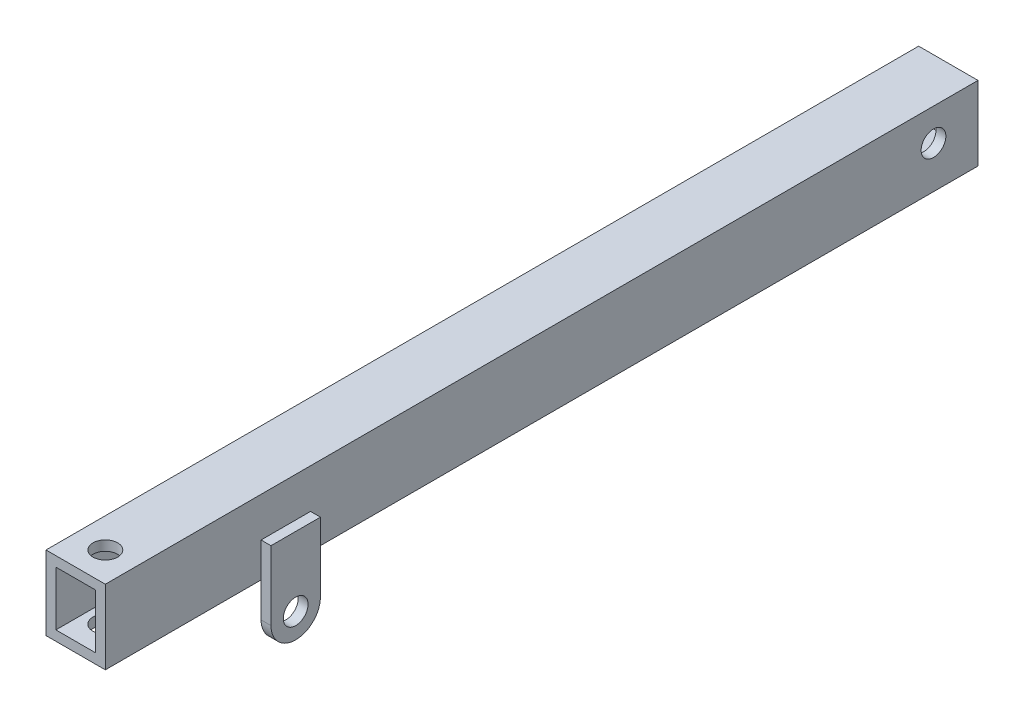
ISO-10303-21;
HEADER;
FILE_DESCRIPTION(('STEP AP214'),'2;1');
FILE_NAME('part.step','',(''),(''),'','','');
FILE_SCHEMA(('AUTOMOTIVE_DESIGN { 1 0 10303 214 1 1 1 1 }'));
ENDSEC;
DATA;
#1=APPLICATION_CONTEXT('core data for automotive mechanical design processes');
#2=APPLICATION_PROTOCOL_DEFINITION('international standard','automotive_design',2000,#1);
#3=PRODUCT_CONTEXT('',#1,'mechanical');
#4=PRODUCT('Part','Part','',(#3));
#5=PRODUCT_RELATED_PRODUCT_CATEGORY('part','',(#4));
#6=PRODUCT_DEFINITION_FORMATION('','',#4);
#7=PRODUCT_DEFINITION_CONTEXT('part definition',#1,'design');
#8=PRODUCT_DEFINITION('design','',#6,#7);
#9=PRODUCT_DEFINITION_SHAPE('','',#8);
#10=(LENGTH_UNIT() NAMED_UNIT(*) SI_UNIT(.MILLI.,.METRE.));
#11=(NAMED_UNIT(*) PLANE_ANGLE_UNIT() SI_UNIT($,.RADIAN.));
#12=(NAMED_UNIT(*) SI_UNIT($,.STERADIAN.) SOLID_ANGLE_UNIT());
#13=UNCERTAINTY_MEASURE_WITH_UNIT(LENGTH_MEASURE(1.E-05),#10,'distance_accuracy_value','');
#14=(GEOMETRIC_REPRESENTATION_CONTEXT(3) GLOBAL_UNCERTAINTY_ASSIGNED_CONTEXT((#13)) GLOBAL_UNIT_ASSIGNED_CONTEXT((#10,
#11,#12)) REPRESENTATION_CONTEXT('',''));
#15=CARTESIAN_POINT('',(0.,0.,0.));
#16=DIRECTION('',(0.,0.,1.));
#17=DIRECTION('',(1.,0.,0.));
#18=AXIS2_PLACEMENT_3D('',#15,#16,#17);
#19=CARTESIAN_POINT('',(6.,-7.5,176.5));
#20=DIRECTION('',(-1.,0.,0.));
#21=DIRECTION('',(0.,0.,1.));
#22=AXIS2_PLACEMENT_3D('',#19,#20,#21);
#23=PLANE('',#22);
#24=CARTESIAN_POINT('',(6.,0.999999999999995,9.));
#25=DIRECTION('',(1.,0.,0.));
#26=DIRECTION('',(0.,0.,-1.));
#27=AXIS2_PLACEMENT_3D('',#24,#25,#26);
#28=CIRCLE('',#27,2.5);
#29=CARTESIAN_POINT('',(6.,0.999999999999995,6.5));
#30=VERTEX_POINT('',#29);
#31=EDGE_CURVE('E441',#30,#30,#28,.T.);
#32=ORIENTED_EDGE('',*,*,#31,.F.);
#33=EDGE_LOOP('',(#32));
#34=FACE_BOUND('',#33,.T.);
#35=DIRECTION('',(0.,0.,-1.));
#36=VECTOR('',#35,1.);
#37=CARTESIAN_POINT('',(6.,-7.5,176.5));
#38=LINE('',#37,#36);
#39=CARTESIAN_POINT('',(6.,-7.5,135.));
#40=VERTEX_POINT('',#39);
#41=CARTESIAN_POINT('',(6.,-7.5,0.));
#42=VERTEX_POINT('',#41);
#43=EDGE_CURVE('E193',#40,#42,#38,.T.);
#44=ORIENTED_EDGE('',*,*,#43,.T.);
#45=DIRECTION('',(0.,1.,0.));
#46=VECTOR('',#45,1.);
#47=CARTESIAN_POINT('',(6.,-7.5,0.));
#48=LINE('',#47,#46);
#49=CARTESIAN_POINT('',(6.,7.5,0.));
#50=VERTEX_POINT('',#49);
#51=EDGE_CURVE('E59',#42,#50,#48,.T.);
#52=ORIENTED_EDGE('',*,*,#51,.T.);
#53=DIRECTION('',(0.,0.,-1.));
#54=VECTOR('',#53,1.);
#55=CARTESIAN_POINT('',(6.,7.5,176.5));
#56=LINE('',#55,#54);
#57=CARTESIAN_POINT('',(6.,7.5,176.5));
#58=VERTEX_POINT('',#57);
#59=EDGE_CURVE('E174',#58,#50,#56,.T.);
#60=ORIENTED_EDGE('',*,*,#59,.F.);
#61=DIRECTION('',(0.,1.,0.));
#62=VECTOR('',#61,1.);
#63=CARTESIAN_POINT('',(6.,-7.5,176.5));
#64=LINE('',#63,#62);
#65=CARTESIAN_POINT('',(6.,-7.5,176.5));
#66=VERTEX_POINT('',#65);
#67=EDGE_CURVE('E206',#66,#58,#64,.T.);
#68=ORIENTED_EDGE('',*,*,#67,.F.);
#69=CARTESIAN_POINT('',(6.,-7.5,145.));
#70=VERTEX_POINT('',#69);
#71=EDGE_CURVE('E183',#66,#70,#38,.T.);
#72=ORIENTED_EDGE('',*,*,#71,.T.);
#73=DIRECTION('',(0.,-1.,0.));
#74=VECTOR('',#73,1.);
#75=CARTESIAN_POINT('',(6.,-14.5,145.));
#76=LINE('',#75,#74);
#77=CARTESIAN_POINT('',(6.,-0.500000000000005,145.));
#78=VERTEX_POINT('',#77);
#79=EDGE_CURVE('E246',#78,#70,#76,.T.);
#80=ORIENTED_EDGE('',*,*,#79,.F.);
#81=DIRECTION('',(0.,0.,1.));
#82=VECTOR('',#81,1.);
#83=CARTESIAN_POINT('',(6.,-0.500000000000005,145.));
#84=LINE('',#83,#82);
#85=CARTESIAN_POINT('',(6.,-0.500000000000005,135.));
#86=VERTEX_POINT('',#85);
#87=EDGE_CURVE('E247',#86,#78,#84,.T.);
#88=ORIENTED_EDGE('',*,*,#87,.F.);
#89=DIRECTION('',(0.,1.,0.));
#90=VECTOR('',#89,1.);
#91=CARTESIAN_POINT('',(6.,-14.5,135.));
#92=LINE('',#91,#90);
#93=EDGE_CURVE('E263',#40,#86,#92,.T.);
#94=ORIENTED_EDGE('',*,*,#93,.F.);
#95=EDGE_LOOP('',(#44,#52,#60,#68,#72,#80,#88,#94));
#96=FACE_BOUND('',#95,.T.);
#97=ADVANCED_FACE('F39',(#34,#96),#23,.F.);
#98=CARTESIAN_POINT('',(-6.,-7.5,176.5));
#99=DIRECTION('',(1.,0.,0.));
#100=DIRECTION('',(0.,0.,-1.));
#101=AXIS2_PLACEMENT_3D('',#98,#99,#100);
#102=PLANE('',#101);
#103=CARTESIAN_POINT('',(-6.,0.999999999999995,9.));
#104=DIRECTION('',(1.,0.,0.));
#105=DIRECTION('',(0.,0.,-1.));
#106=AXIS2_PLACEMENT_3D('',#103,#104,#105);
#107=CIRCLE('',#106,2.5);
#108=CARTESIAN_POINT('',(-6.,0.999999999999995,6.5));
#109=VERTEX_POINT('',#108);
#110=EDGE_CURVE('E404',#109,#109,#107,.T.);
#111=ORIENTED_EDGE('',*,*,#110,.T.);
#112=EDGE_LOOP('',(#111));
#113=FACE_BOUND('',#112,.T.);
#114=DIRECTION('',(0.,0.,-1.));
#115=VECTOR('',#114,1.);
#116=CARTESIAN_POINT('',(-6.,7.5,176.5));
#117=LINE('',#116,#115);
#118=CARTESIAN_POINT('',(-6.,7.5,176.5));
#119=VERTEX_POINT('',#118);
#120=CARTESIAN_POINT('',(-6.,7.5,0.));
#121=VERTEX_POINT('',#120);
#122=EDGE_CURVE('E171',#119,#121,#117,.T.);
#123=ORIENTED_EDGE('',*,*,#122,.T.);
#124=DIRECTION('',(0.,1.,0.));
#125=VECTOR('',#124,1.);
#126=CARTESIAN_POINT('',(-6.,7.5,0.));
#127=LINE('',#126,#125);
#128=CARTESIAN_POINT('',(-6.,-7.5,0.));
#129=VERTEX_POINT('',#128);
#130=EDGE_CURVE('E11',#129,#121,#127,.T.);
#131=ORIENTED_EDGE('',*,*,#130,.F.);
#132=DIRECTION('',(0.,0.,-1.));
#133=VECTOR('',#132,1.);
#134=CARTESIAN_POINT('',(-6.,-7.5,176.5));
#135=LINE('',#134,#133);
#136=CARTESIAN_POINT('',(-6.,-7.5,135.));
#137=VERTEX_POINT('',#136);
#138=EDGE_CURVE('E348',#137,#129,#135,.T.);
#139=ORIENTED_EDGE('',*,*,#138,.F.);
#140=DIRECTION('',(0.,1.,0.));
#141=VECTOR('',#140,1.);
#142=CARTESIAN_POINT('',(-6.,-14.5,135.));
#143=LINE('',#142,#141);
#144=CARTESIAN_POINT('',(-6.,-0.500000000000005,135.));
#145=VERTEX_POINT('',#144);
#146=EDGE_CURVE('E182',#137,#145,#143,.T.);
#147=ORIENTED_EDGE('',*,*,#146,.T.);
#148=DIRECTION('',(0.,0.,1.));
#149=VECTOR('',#148,1.);
#150=CARTESIAN_POINT('',(-6.,-0.500000000000005,145.));
#151=LINE('',#150,#149);
#152=CARTESIAN_POINT('',(-6.,-0.500000000000005,145.));
#153=VERTEX_POINT('',#152);
#154=EDGE_CURVE('E188',#145,#153,#151,.T.);
#155=ORIENTED_EDGE('',*,*,#154,.T.);
#156=DIRECTION('',(0.,-1.,0.));
#157=VECTOR('',#156,1.);
#158=CARTESIAN_POINT('',(-6.,-14.5,145.));
#159=LINE('',#158,#157);
#160=CARTESIAN_POINT('',(-6.,-7.5,145.));
#161=VERTEX_POINT('',#160);
#162=EDGE_CURVE('E210',#153,#161,#159,.T.);
#163=ORIENTED_EDGE('',*,*,#162,.T.);
#164=CARTESIAN_POINT('',(-6.,-7.5,176.5));
#165=VERTEX_POINT('',#164);
#166=EDGE_CURVE('E362',#165,#161,#135,.T.);
#167=ORIENTED_EDGE('',*,*,#166,.F.);
#168=DIRECTION('',(0.,-1.,0.));
#169=VECTOR('',#168,1.);
#170=CARTESIAN_POINT('',(-6.,-7.5,176.5));
#171=LINE('',#170,#169);
#172=EDGE_CURVE('E180',#119,#165,#171,.T.);
#173=ORIENTED_EDGE('',*,*,#172,.F.);
#174=EDGE_LOOP('',(#123,#131,#139,#147,#155,#163,#167,#173));
#175=FACE_BOUND('',#174,.T.);
#176=ADVANCED_FACE('F178',(#113,#175),#102,.F.);
#177=CARTESIAN_POINT('',(0.,0.,176.5));
#178=DIRECTION('',(0.,0.,-1.));
#179=DIRECTION('',(-1.,0.,0.));
#180=AXIS2_PLACEMENT_3D('',#177,#178,#179);
#181=PLANE('',#180);
#182=ORIENTED_EDGE('',*,*,#67,.T.);
#183=DIRECTION('',(-1.,0.,0.));
#184=VECTOR('',#183,1.);
#185=CARTESIAN_POINT('',(-6.,7.5,176.5));
#186=LINE('',#185,#184);
#187=EDGE_CURVE('E203',#58,#119,#186,.T.);
#188=ORIENTED_EDGE('',*,*,#187,.T.);
#189=ORIENTED_EDGE('',*,*,#172,.T.);
#190=DIRECTION('',(1.,0.,0.));
#191=VECTOR('',#190,1.);
#192=CARTESIAN_POINT('',(-6.,-7.5,176.5));
#193=LINE('',#192,#191);
#194=EDGE_CURVE('E198',#165,#66,#193,.T.);
#195=ORIENTED_EDGE('',*,*,#194,.T.);
#196=EDGE_LOOP('',(#182,#188,#189,#195));
#197=FACE_BOUND('',#196,.T.);
#198=DIRECTION('',(0.,1.,0.));
#199=VECTOR('',#198,1.);
#200=CARTESIAN_POINT('',(4.,-5.5,176.5));
#201=LINE('',#200,#199);
#202=CARTESIAN_POINT('',(4.,-5.5,176.5));
#203=VERTEX_POINT('',#202);
#204=CARTESIAN_POINT('',(4.,5.5,176.5));
#205=VERTEX_POINT('',#204);
#206=EDGE_CURVE('E216',#203,#205,#201,.T.);
#207=ORIENTED_EDGE('',*,*,#206,.F.);
#208=DIRECTION('',(1.,0.,0.));
#209=VECTOR('',#208,1.);
#210=CARTESIAN_POINT('',(-4.,-5.5,176.5));
#211=LINE('',#210,#209);
#212=CARTESIAN_POINT('',(-4.,-5.5,176.5));
#213=VERTEX_POINT('',#212);
#214=EDGE_CURVE('E226',#213,#203,#211,.T.);
#215=ORIENTED_EDGE('',*,*,#214,.F.);
#216=DIRECTION('',(0.,-1.,0.));
#217=VECTOR('',#216,1.);
#218=CARTESIAN_POINT('',(-4.,-5.5,176.5));
#219=LINE('',#218,#217);
#220=CARTESIAN_POINT('',(-4.,5.5,176.5));
#221=VERTEX_POINT('',#220);
#222=EDGE_CURVE('E221',#221,#213,#219,.T.);
#223=ORIENTED_EDGE('',*,*,#222,.F.);
#224=DIRECTION('',(-1.,0.,0.));
#225=VECTOR('',#224,1.);
#226=CARTESIAN_POINT('',(-4.,5.5,176.5));
#227=LINE('',#226,#225);
#228=EDGE_CURVE('E215',#205,#221,#227,.T.);
#229=ORIENTED_EDGE('',*,*,#228,.F.);
#230=EDGE_LOOP('',(#207,#215,#223,#229));
#231=FACE_BOUND('',#230,.T.);
#232=ADVANCED_FACE('F396',(#197,#231),#181,.F.);
#233=CARTESIAN_POINT('',(-6.,7.5,176.5));
#234=DIRECTION('',(0.,-1.,0.));
#235=DIRECTION('',(0.,0.,-1.));
#236=AXIS2_PLACEMENT_3D('',#233,#234,#235);
#237=PLANE('',#236);
#238=CARTESIAN_POINT('',(6.10622663543836E-13,7.5,170.499999999997));
#239=DIRECTION('',(0.,1.,0.));
#240=DIRECTION('',(0.,0.,1.));
#241=AXIS2_PLACEMENT_3D('',#238,#239,#240);
#242=CIRCLE('',#241,2.5);
#243=CARTESIAN_POINT('',(6.10622663543836E-13,7.5,172.999999999997));
#244=VERTEX_POINT('',#243);
#245=EDGE_CURVE('E353',#244,#244,#242,.T.);
#246=ORIENTED_EDGE('',*,*,#245,.F.);
#247=EDGE_LOOP('',(#246));
#248=FACE_BOUND('',#247,.T.);
#249=ORIENTED_EDGE('',*,*,#59,.T.);
#250=DIRECTION('',(-1.,0.,0.));
#251=VECTOR('',#250,1.);
#252=CARTESIAN_POINT('',(8.,7.5,0.));
#253=LINE('',#252,#251);
#254=EDGE_CURVE('E162',#50,#121,#253,.T.);
#255=ORIENTED_EDGE('',*,*,#254,.T.);
#256=ORIENTED_EDGE('',*,*,#122,.F.);
#257=ORIENTED_EDGE('',*,*,#187,.F.);
#258=EDGE_LOOP('',(#249,#255,#256,#257));
#259=FACE_BOUND('',#258,.T.);
#260=ADVANCED_FACE('F170',(#248,#259),#237,.F.);
#261=CARTESIAN_POINT('',(-6.,-7.5,176.5));
#262=DIRECTION('',(0.,1.,0.));
#263=DIRECTION('',(0.,0.,1.));
#264=AXIS2_PLACEMENT_3D('',#261,#262,#263);
#265=PLANE('',#264);
#266=CARTESIAN_POINT('',(6.10622663543836E-13,-7.5,170.499999999997));
#267=DIRECTION('',(0.,1.,0.));
#268=DIRECTION('',(0.,0.,1.));
#269=AXIS2_PLACEMENT_3D('',#266,#267,#268);
#270=CIRCLE('',#269,2.5);
#271=CARTESIAN_POINT('',(6.10622663543836E-13,-7.5,172.999999999997));
#272=VERTEX_POINT('',#271);
#273=EDGE_CURVE('E176',#272,#272,#270,.T.);
#274=ORIENTED_EDGE('',*,*,#273,.T.);
#275=EDGE_LOOP('',(#274));
#276=FACE_BOUND('',#275,.T.);
#277=ORIENTED_EDGE('',*,*,#138,.T.);
#278=DIRECTION('',(1.,0.,0.));
#279=VECTOR('',#278,1.);
#280=CARTESIAN_POINT('',(-6.,-7.5,0.));
#281=LINE('',#280,#279);
#282=EDGE_CURVE('E159',#129,#42,#281,.T.);
#283=ORIENTED_EDGE('',*,*,#282,.T.);
#284=ORIENTED_EDGE('',*,*,#43,.F.);
#285=EDGE_CURVE('E194',#70,#40,#38,.T.);
#286=ORIENTED_EDGE('',*,*,#285,.F.);
#287=ORIENTED_EDGE('',*,*,#71,.F.);
#288=ORIENTED_EDGE('',*,*,#194,.F.);
#289=ORIENTED_EDGE('',*,*,#166,.T.);
#290=EDGE_CURVE('E241',#161,#137,#135,.T.);
#291=ORIENTED_EDGE('',*,*,#290,.T.);
#292=EDGE_LOOP('',(#277,#283,#284,#286,#287,#288,#289,#291));
#293=FACE_BOUND('',#292,.T.);
#294=ADVANCED_FACE('F377',(#276,#293),#265,.F.);
#295=CARTESIAN_POINT('',(4.,-5.5,176.5));
#296=DIRECTION('',(-1.,0.,0.));
#297=DIRECTION('',(0.,0.,1.));
#298=AXIS2_PLACEMENT_3D('',#295,#296,#297);
#299=PLANE('',#298);
#300=CARTESIAN_POINT('',(4.,0.999999999999995,9.));
#301=DIRECTION('',(-1.,0.,0.));
#302=DIRECTION('',(0.,0.,1.));
#303=AXIS2_PLACEMENT_3D('',#300,#301,#302);
#304=CIRCLE('',#303,2.5);
#305=CARTESIAN_POINT('',(4.,0.999999999999995,11.5));
#306=VERTEX_POINT('',#305);
#307=EDGE_CURVE('E407',#306,#306,#304,.T.);
#308=ORIENTED_EDGE('',*,*,#307,.F.);
#309=EDGE_LOOP('',(#308));
#310=FACE_BOUND('',#309,.T.);
#311=DIRECTION('',(0.,1.,0.));
#312=VECTOR('',#311,1.);
#313=CARTESIAN_POINT('',(4.,-5.5,0.));
#314=LINE('',#313,#312);
#315=CARTESIAN_POINT('',(4.,-5.5,0.));
#316=VERTEX_POINT('',#315);
#317=CARTESIAN_POINT('',(4.,5.5,0.));
#318=VERTEX_POINT('',#317);
#319=EDGE_CURVE('E357',#316,#318,#314,.T.);
#320=ORIENTED_EDGE('',*,*,#319,.F.);
#321=DIRECTION('',(0.,0.,-1.));
#322=VECTOR('',#321,1.);
#323=CARTESIAN_POINT('',(4.,-5.5,176.5));
#324=LINE('',#323,#322);
#325=EDGE_CURVE('E227',#203,#316,#324,.T.);
#326=ORIENTED_EDGE('',*,*,#325,.F.);
#327=ORIENTED_EDGE('',*,*,#206,.T.);
#328=DIRECTION('',(0.,0.,-1.));
#329=VECTOR('',#328,1.);
#330=CARTESIAN_POINT('',(4.,5.5,176.5));
#331=LINE('',#330,#329);
#332=EDGE_CURVE('E211',#205,#318,#331,.T.);
#333=ORIENTED_EDGE('',*,*,#332,.T.);
#334=EDGE_LOOP('',(#320,#326,#327,#333));
#335=FACE_BOUND('',#334,.T.);
#336=ADVANCED_FACE('F473',(#310,#335),#299,.T.);
#337=CARTESIAN_POINT('',(-4.,5.5,176.5));
#338=DIRECTION('',(0.,-1.,0.));
#339=DIRECTION('',(0.,0.,-1.));
#340=AXIS2_PLACEMENT_3D('',#337,#338,#339);
#341=PLANE('',#340);
#342=DIRECTION('',(-1.,0.,0.));
#343=VECTOR('',#342,1.);
#344=CARTESIAN_POINT('',(-4.,5.5,0.));
#345=LINE('',#344,#343);
#346=CARTESIAN_POINT('',(-4.,5.5,0.));
#347=VERTEX_POINT('',#346);
#348=EDGE_CURVE('E365',#318,#347,#345,.T.);
#349=ORIENTED_EDGE('',*,*,#348,.F.);
#350=ORIENTED_EDGE('',*,*,#332,.F.);
#351=ORIENTED_EDGE('',*,*,#228,.T.);
#352=DIRECTION('',(0.,0.,-1.));
#353=VECTOR('',#352,1.);
#354=CARTESIAN_POINT('',(-4.,5.5,176.5));
#355=LINE('',#354,#353);
#356=EDGE_CURVE('E217',#221,#347,#355,.T.);
#357=ORIENTED_EDGE('',*,*,#356,.T.);
#358=EDGE_LOOP('',(#349,#350,#351,#357));
#359=FACE_BOUND('',#358,.T.);
#360=CARTESIAN_POINT('',(6.10622663543836E-13,5.5,170.499999999997));
#361=DIRECTION('',(0.,-1.,0.));
#362=DIRECTION('',(0.,0.,-1.));
#363=AXIS2_PLACEMENT_3D('',#360,#361,#362);
#364=CIRCLE('',#363,2.5);
#365=CARTESIAN_POINT('',(6.10622663543836E-13,5.5,167.999999999997));
#366=VERTEX_POINT('',#365);
#367=EDGE_CURVE('E349',#366,#366,#364,.T.);
#368=ORIENTED_EDGE('',*,*,#367,.F.);
#369=EDGE_LOOP('',(#368));
#370=FACE_BOUND('',#369,.T.);
#371=ADVANCED_FACE('F457',(#359,#370),#341,.T.);
#372=CARTESIAN_POINT('',(-4.,-5.5,176.5));
#373=DIRECTION('',(1.,0.,0.));
#374=DIRECTION('',(0.,0.,-1.));
#375=AXIS2_PLACEMENT_3D('',#372,#373,#374);
#376=PLANE('',#375);
#377=CARTESIAN_POINT('',(-4.,0.999999999999995,9.));
#378=DIRECTION('',(1.,0.,0.));
#379=DIRECTION('',(0.,0.,-1.));
#380=AXIS2_PLACEMENT_3D('',#377,#378,#379);
#381=CIRCLE('',#380,2.5);
#382=CARTESIAN_POINT('',(-4.,0.999999999999995,6.5));
#383=VERTEX_POINT('',#382);
#384=EDGE_CURVE('E43',#383,#383,#381,.T.);
#385=ORIENTED_EDGE('',*,*,#384,.F.);
#386=EDGE_LOOP('',(#385));
#387=FACE_BOUND('',#386,.T.);
#388=DIRECTION('',(0.,-1.,0.));
#389=VECTOR('',#388,1.);
#390=CARTESIAN_POINT('',(-4.,-5.5,0.));
#391=LINE('',#390,#389);
#392=CARTESIAN_POINT('',(-4.,-5.5,0.));
#393=VERTEX_POINT('',#392);
#394=EDGE_CURVE('E368',#347,#393,#391,.T.);
#395=ORIENTED_EDGE('',*,*,#394,.F.);
#396=ORIENTED_EDGE('',*,*,#356,.F.);
#397=ORIENTED_EDGE('',*,*,#222,.T.);
#398=DIRECTION('',(0.,0.,-1.));
#399=VECTOR('',#398,1.);
#400=CARTESIAN_POINT('',(-4.,-5.5,176.5));
#401=LINE('',#400,#399);
#402=EDGE_CURVE('E222',#213,#393,#401,.T.);
#403=ORIENTED_EDGE('',*,*,#402,.T.);
#404=EDGE_LOOP('',(#395,#396,#397,#403));
#405=FACE_BOUND('',#404,.T.);
#406=ADVANCED_FACE('F453',(#387,#405),#376,.T.);
#407=CARTESIAN_POINT('',(-4.,-5.5,176.5));
#408=DIRECTION('',(0.,1.,0.));
#409=DIRECTION('',(0.,0.,1.));
#410=AXIS2_PLACEMENT_3D('',#407,#408,#409);
#411=PLANE('',#410);
#412=DIRECTION('',(1.,0.,0.));
#413=VECTOR('',#412,1.);
#414=CARTESIAN_POINT('',(-4.,-5.5,0.));
#415=LINE('',#414,#413);
#416=EDGE_CURVE('E50',#393,#316,#415,.T.);
#417=ORIENTED_EDGE('',*,*,#416,.F.);
#418=ORIENTED_EDGE('',*,*,#402,.F.);
#419=ORIENTED_EDGE('',*,*,#214,.T.);
#420=ORIENTED_EDGE('',*,*,#325,.T.);
#421=EDGE_LOOP('',(#417,#418,#419,#420));
#422=FACE_BOUND('',#421,.T.);
#423=CARTESIAN_POINT('',(6.10622663543836E-13,-5.5,170.499999999997));
#424=DIRECTION('',(0.,1.,0.));
#425=DIRECTION('',(0.,0.,1.));
#426=AXIS2_PLACEMENT_3D('',#423,#424,#425);
#427=CIRCLE('',#426,2.5);
#428=CARTESIAN_POINT('',(6.10622663543836E-13,-5.5,172.999999999997));
#429=VERTEX_POINT('',#428);
#430=EDGE_CURVE('E341',#429,#429,#427,.T.);
#431=ORIENTED_EDGE('',*,*,#430,.F.);
#432=EDGE_LOOP('',(#431));
#433=FACE_BOUND('',#432,.T.);
#434=ADVANCED_FACE('F456',(#422,#433),#411,.T.);
#435=CARTESIAN_POINT('',(6.,-14.5,140.));
#436=DIRECTION('',(1.,0.,0.));
#437=DIRECTION('',(0.,0.,-1.));
#438=AXIS2_PLACEMENT_3D('',#435,#436,#437);
#439=PLANE('',#438);
#440=CARTESIAN_POINT('',(6.,-14.5,140.));
#441=DIRECTION('',(1.,0.,0.));
#442=DIRECTION('',(0.,0.,-1.));
#443=AXIS2_PLACEMENT_3D('',#440,#441,#442);
#444=CIRCLE('',#443,2.5);
#445=CARTESIAN_POINT('',(6.,-14.5,137.5));
#446=VERTEX_POINT('',#445);
#447=EDGE_CURVE('E231',#446,#446,#444,.T.);
#448=ORIENTED_EDGE('',*,*,#447,.T.);
#449=EDGE_LOOP('',(#448));
#450=FACE_BOUND('',#449,.T.);
#451=CARTESIAN_POINT('',(6.,-14.5,145.));
#452=VERTEX_POINT('',#451);
#453=EDGE_CURVE('E253',#70,#452,#76,.T.);
#454=ORIENTED_EDGE('',*,*,#453,.F.);
#455=ORIENTED_EDGE('',*,*,#285,.T.);
#456=CARTESIAN_POINT('',(6.,-14.5,135.));
#457=VERTEX_POINT('',#456);
#458=EDGE_CURVE('E272',#457,#40,#92,.T.);
#459=ORIENTED_EDGE('',*,*,#458,.F.);
#460=CARTESIAN_POINT('',(6.,-14.5,140.));
#461=DIRECTION('',(1.,0.,0.));
#462=DIRECTION('',(0.,0.,-1.));
#463=AXIS2_PLACEMENT_3D('',#460,#461,#462);
#464=CIRCLE('',#463,5.00000000000002);
#465=EDGE_CURVE('E252',#452,#457,#464,.T.);
#466=ORIENTED_EDGE('',*,*,#465,.F.);
#467=EDGE_LOOP('',(#454,#455,#459,#466));
#468=FACE_BOUND('',#467,.T.);
#469=ADVANCED_FACE('F413',(#450,#468),#439,.F.);
#470=CARTESIAN_POINT('',(8.,-14.5,140.));
#471=DIRECTION('',(1.,0.,0.));
#472=DIRECTION('',(0.,0.,-1.));
#473=AXIS2_PLACEMENT_3D('',#470,#471,#472);
#474=PLANE('',#473);
#475=DIRECTION('',(0.,1.,0.));
#476=VECTOR('',#475,1.);
#477=CARTESIAN_POINT('',(8.,-14.5,135.));
#478=LINE('',#477,#476);
#479=CARTESIAN_POINT('',(8.,-14.5,135.));
#480=VERTEX_POINT('',#479);
#481=CARTESIAN_POINT('',(8.,-0.500000000000005,135.));
#482=VERTEX_POINT('',#481);
#483=EDGE_CURVE('E285',#480,#482,#478,.T.);
#484=ORIENTED_EDGE('',*,*,#483,.T.);
#485=DIRECTION('',(0.,0.,1.));
#486=VECTOR('',#485,1.);
#487=CARTESIAN_POINT('',(8.,-0.500000000000005,145.));
#488=LINE('',#487,#486);
#489=CARTESIAN_POINT('',(8.,-0.500000000000005,145.));
#490=VERTEX_POINT('',#489);
#491=EDGE_CURVE('E282',#482,#490,#488,.T.);
#492=ORIENTED_EDGE('',*,*,#491,.T.);
#493=DIRECTION('',(0.,-1.,0.));
#494=VECTOR('',#493,1.);
#495=CARTESIAN_POINT('',(8.,-14.5,145.));
#496=LINE('',#495,#494);
#497=CARTESIAN_POINT('',(8.,-14.5,145.));
#498=VERTEX_POINT('',#497);
#499=EDGE_CURVE('E279',#490,#498,#496,.T.);
#500=ORIENTED_EDGE('',*,*,#499,.T.);
#501=CARTESIAN_POINT('',(8.,-14.5,140.));
#502=DIRECTION('',(1.,0.,0.));
#503=DIRECTION('',(0.,0.,-1.));
#504=AXIS2_PLACEMENT_3D('',#501,#502,#503);
#505=CIRCLE('',#504,5.00000000000002);
#506=EDGE_CURVE('E276',#498,#480,#505,.T.);
#507=ORIENTED_EDGE('',*,*,#506,.T.);
#508=EDGE_LOOP('',(#484,#492,#500,#507));
#509=FACE_BOUND('',#508,.T.);
#510=CARTESIAN_POINT('',(8.,-14.5,140.));
#511=DIRECTION('',(1.,0.,0.));
#512=DIRECTION('',(0.,0.,-1.));
#513=AXIS2_PLACEMENT_3D('',#510,#511,#512);
#514=CIRCLE('',#513,2.5);
#515=CARTESIAN_POINT('',(8.,-14.5,137.5));
#516=VERTEX_POINT('',#515);
#517=EDGE_CURVE('E258',#516,#516,#514,.T.);
#518=ORIENTED_EDGE('',*,*,#517,.F.);
#519=EDGE_LOOP('',(#518));
#520=FACE_BOUND('',#519,.T.);
#521=ADVANCED_FACE('F511',(#509,#520),#474,.T.);
#522=CARTESIAN_POINT('',(8.,-14.5,135.));
#523=DIRECTION('',(0.,0.,1.));
#524=DIRECTION('',(1.,0.,0.));
#525=AXIS2_PLACEMENT_3D('',#522,#523,#524);
#526=PLANE('',#525);
#527=ORIENTED_EDGE('',*,*,#458,.T.);
#528=ORIENTED_EDGE('',*,*,#93,.T.);
#529=DIRECTION('',(-1.,0.,0.));
#530=VECTOR('',#529,1.);
#531=CARTESIAN_POINT('',(8.,-0.500000000000005,135.));
#532=LINE('',#531,#530);
#533=EDGE_CURVE('E242',#482,#86,#532,.T.);
#534=ORIENTED_EDGE('',*,*,#533,.F.);
#535=ORIENTED_EDGE('',*,*,#483,.F.);
#536=DIRECTION('',(-1.,0.,0.));
#537=VECTOR('',#536,1.);
#538=CARTESIAN_POINT('',(8.,-14.5,135.));
#539=LINE('',#538,#537);
#540=EDGE_CURVE('E259',#480,#457,#539,.T.);
#541=ORIENTED_EDGE('',*,*,#540,.T.);
#542=EDGE_LOOP('',(#527,#528,#534,#535,#541));
#543=FACE_BOUND('',#542,.T.);
#544=ADVANCED_FACE('F416',(#543),#526,.F.);
#545=CARTESIAN_POINT('',(8.,-0.500000000000005,145.));
#546=DIRECTION('',(0.,-1.,0.));
#547=DIRECTION('',(0.,0.,-1.));
#548=AXIS2_PLACEMENT_3D('',#545,#546,#547);
#549=PLANE('',#548);
#550=ORIENTED_EDGE('',*,*,#87,.T.);
#551=DIRECTION('',(-1.,0.,0.));
#552=VECTOR('',#551,1.);
#553=CARTESIAN_POINT('',(8.,-0.500000000000005,145.));
#554=LINE('',#553,#552);
#555=EDGE_CURVE('E248',#490,#78,#554,.T.);
#556=ORIENTED_EDGE('',*,*,#555,.F.);
#557=ORIENTED_EDGE('',*,*,#491,.F.);
#558=ORIENTED_EDGE('',*,*,#533,.T.);
#559=EDGE_LOOP('',(#550,#556,#557,#558));
#560=FACE_BOUND('',#559,.T.);
#561=ADVANCED_FACE('F510',(#560),#549,.F.);
#562=CARTESIAN_POINT('',(8.,-14.5,145.));
#563=DIRECTION('',(0.,0.,-1.));
#564=DIRECTION('',(0.,1.,0.));
#565=AXIS2_PLACEMENT_3D('',#562,#563,#564);
#566=PLANE('',#565);
#567=ORIENTED_EDGE('',*,*,#79,.T.);
#568=ORIENTED_EDGE('',*,*,#453,.T.);
#569=DIRECTION('',(-1.,0.,0.));
#570=VECTOR('',#569,1.);
#571=CARTESIAN_POINT('',(8.,-14.5,145.));
#572=LINE('',#571,#570);
#573=EDGE_CURVE('E254',#498,#452,#572,.T.);
#574=ORIENTED_EDGE('',*,*,#573,.F.);
#575=ORIENTED_EDGE('',*,*,#499,.F.);
#576=ORIENTED_EDGE('',*,*,#555,.T.);
#577=EDGE_LOOP('',(#567,#568,#574,#575,#576));
#578=FACE_BOUND('',#577,.T.);
#579=ADVANCED_FACE('F426',(#578),#566,.F.);
#580=CARTESIAN_POINT('',(8.,-14.5,140.));
#581=DIRECTION('',(-1.,0.,0.));
#582=DIRECTION('',(0.,0.,1.));
#583=AXIS2_PLACEMENT_3D('',#580,#581,#582);
#584=CYLINDRICAL_SURFACE('',#583,5.00000000000002);
#585=ORIENTED_EDGE('',*,*,#465,.T.);
#586=ORIENTED_EDGE('',*,*,#540,.F.);
#587=ORIENTED_EDGE('',*,*,#506,.F.);
#588=ORIENTED_EDGE('',*,*,#573,.T.);
#589=EDGE_LOOP('',(#585,#586,#587,#588));
#590=FACE_BOUND('',#589,.T.);
#591=ADVANCED_FACE('F422',(#590),#584,.T.);
#592=CARTESIAN_POINT('',(8.,-14.5,140.));
#593=DIRECTION('',(-1.,0.,0.));
#594=DIRECTION('',(0.,0.,1.));
#595=AXIS2_PLACEMENT_3D('',#592,#593,#594);
#596=CYLINDRICAL_SURFACE('',#595,2.5);
#597=ORIENTED_EDGE('',*,*,#517,.T.);
#598=EDGE_LOOP('',(#597));
#599=FACE_BOUND('',#598,.T.);
#600=ORIENTED_EDGE('',*,*,#447,.F.);
#601=EDGE_LOOP('',(#600));
#602=FACE_BOUND('',#601,.T.);
#603=ADVANCED_FACE('F519',(#599,#602),#596,.F.);
#604=CARTESIAN_POINT('',(-6.,-14.5,140.));
#605=DIRECTION('',(-1.,0.,0.));
#606=DIRECTION('',(0.,0.,-1.));
#607=AXIS2_PLACEMENT_3D('',#604,#605,#606);
#608=PLANE('',#607);
#609=CARTESIAN_POINT('',(-6.,-14.5,140.));
#610=DIRECTION('',(1.,0.,0.));
#611=DIRECTION('',(0.,0.,-1.));
#612=AXIS2_PLACEMENT_3D('',#609,#610,#611);
#613=CIRCLE('',#612,2.5);
#614=CARTESIAN_POINT('',(-6.,-14.5,137.5));
#615=VERTEX_POINT('',#614);
#616=EDGE_CURVE('E337',#615,#615,#613,.T.);
#617=ORIENTED_EDGE('',*,*,#616,.F.);
#618=EDGE_LOOP('',(#617));
#619=FACE_BOUND('',#618,.T.);
#620=CARTESIAN_POINT('',(-6.,-14.5,135.));
#621=VERTEX_POINT('',#620);
#622=EDGE_CURVE('E190',#621,#137,#143,.T.);
#623=ORIENTED_EDGE('',*,*,#622,.T.);
#624=ORIENTED_EDGE('',*,*,#290,.F.);
#625=CARTESIAN_POINT('',(-6.,-14.5,145.));
#626=VERTEX_POINT('',#625);
#627=EDGE_CURVE('E319',#161,#626,#159,.T.);
#628=ORIENTED_EDGE('',*,*,#627,.T.);
#629=CARTESIAN_POINT('',(-6.,-14.5,140.));
#630=DIRECTION('',(1.,0.,0.));
#631=DIRECTION('',(0.,0.,-1.));
#632=AXIS2_PLACEMENT_3D('',#629,#630,#631);
#633=CIRCLE('',#632,5.00000000000002);
#634=EDGE_CURVE('E320',#626,#621,#633,.T.);
#635=ORIENTED_EDGE('',*,*,#634,.T.);
#636=EDGE_LOOP('',(#623,#624,#628,#635));
#637=FACE_BOUND('',#636,.T.);
#638=ADVANCED_FACE('F528',(#619,#637),#608,.F.);
#639=CARTESIAN_POINT('',(-8.,-14.5,135.));
#640=DIRECTION('',(0.,0.,-1.));
#641=DIRECTION('',(-1.,0.,0.));
#642=AXIS2_PLACEMENT_3D('',#639,#640,#641);
#643=PLANE('',#642);
#644=ORIENTED_EDGE('',*,*,#622,.F.);
#645=DIRECTION('',(1.,0.,0.));
#646=VECTOR('',#645,1.);
#647=CARTESIAN_POINT('',(-8.,-14.5,135.));
#648=LINE('',#647,#646);
#649=CARTESIAN_POINT('',(-8.,-14.5,135.));
#650=VERTEX_POINT('',#649);
#651=EDGE_CURVE('E295',#650,#621,#648,.T.);
#652=ORIENTED_EDGE('',*,*,#651,.F.);
#653=DIRECTION('',(0.,1.,0.));
#654=VECTOR('',#653,1.);
#655=CARTESIAN_POINT('',(-8.,-14.5,135.));
#656=LINE('',#655,#654);
#657=CARTESIAN_POINT('',(-8.,-0.500000000000005,135.));
#658=VERTEX_POINT('',#657);
#659=EDGE_CURVE('E312',#650,#658,#656,.T.);
#660=ORIENTED_EDGE('',*,*,#659,.T.);
#661=DIRECTION('',(1.,0.,0.));
#662=VECTOR('',#661,1.);
#663=CARTESIAN_POINT('',(-8.,-0.500000000000005,135.));
#664=LINE('',#663,#662);
#665=EDGE_CURVE('E309',#658,#145,#664,.T.);
#666=ORIENTED_EDGE('',*,*,#665,.T.);
#667=ORIENTED_EDGE('',*,*,#146,.F.);
#668=EDGE_LOOP('',(#644,#652,#660,#666,#667));
#669=FACE_BOUND('',#668,.T.);
#670=ADVANCED_FACE('F383',(#669),#643,.T.);
#671=CARTESIAN_POINT('',(-8.,-14.5,140.));
#672=DIRECTION('',(1.,0.,0.));
#673=DIRECTION('',(0.,0.,-1.));
#674=AXIS2_PLACEMENT_3D('',#671,#672,#673);
#675=CYLINDRICAL_SURFACE('',#674,5.00000000000002);
#676=ORIENTED_EDGE('',*,*,#634,.F.);
#677=DIRECTION('',(1.,0.,0.));
#678=VECTOR('',#677,1.);
#679=CARTESIAN_POINT('',(-8.,-14.5,145.));
#680=LINE('',#679,#678);
#681=CARTESIAN_POINT('',(-8.,-14.5,145.));
#682=VERTEX_POINT('',#681);
#683=EDGE_CURVE('E300',#682,#626,#680,.T.);
#684=ORIENTED_EDGE('',*,*,#683,.F.);
#685=CARTESIAN_POINT('',(-8.,-14.5,140.));
#686=DIRECTION('',(1.,0.,0.));
#687=DIRECTION('',(0.,0.,-1.));
#688=AXIS2_PLACEMENT_3D('',#685,#686,#687);
#689=CIRCLE('',#688,5.00000000000002);
#690=EDGE_CURVE('E299',#682,#650,#689,.T.);
#691=ORIENTED_EDGE('',*,*,#690,.T.);
#692=ORIENTED_EDGE('',*,*,#651,.T.);
#693=EDGE_LOOP('',(#676,#684,#691,#692));
#694=FACE_BOUND('',#693,.T.);
#695=ADVANCED_FACE('F532',(#694),#675,.T.);
#696=CARTESIAN_POINT('',(-8.,-14.5,145.));
#697=DIRECTION('',(0.,0.,1.));
#698=DIRECTION('',(0.,-1.,0.));
#699=AXIS2_PLACEMENT_3D('',#696,#697,#698);
#700=PLANE('',#699);
#701=ORIENTED_EDGE('',*,*,#162,.F.);
#702=DIRECTION('',(1.,0.,0.));
#703=VECTOR('',#702,1.);
#704=CARTESIAN_POINT('',(-8.,-0.500000000000005,145.));
#705=LINE('',#704,#703);
#706=CARTESIAN_POINT('',(-8.,-0.500000000000005,145.));
#707=VERTEX_POINT('',#706);
#708=EDGE_CURVE('E305',#707,#153,#705,.T.);
#709=ORIENTED_EDGE('',*,*,#708,.F.);
#710=DIRECTION('',(0.,-1.,0.));
#711=VECTOR('',#710,1.);
#712=CARTESIAN_POINT('',(-8.,-14.5,145.));
#713=LINE('',#712,#711);
#714=EDGE_CURVE('E298',#707,#682,#713,.T.);
#715=ORIENTED_EDGE('',*,*,#714,.T.);
#716=ORIENTED_EDGE('',*,*,#683,.T.);
#717=ORIENTED_EDGE('',*,*,#627,.F.);
#718=EDGE_LOOP('',(#701,#709,#715,#716,#717));
#719=FACE_BOUND('',#718,.T.);
#720=ADVANCED_FACE('F392',(#719),#700,.T.);
#721=CARTESIAN_POINT('',(-8.,-0.500000000000005,145.));
#722=DIRECTION('',(0.,1.,0.));
#723=DIRECTION('',(0.,0.,1.));
#724=AXIS2_PLACEMENT_3D('',#721,#722,#723);
#725=PLANE('',#724);
#726=ORIENTED_EDGE('',*,*,#154,.F.);
#727=ORIENTED_EDGE('',*,*,#665,.F.);
#728=DIRECTION('',(0.,0.,1.));
#729=VECTOR('',#728,1.);
#730=CARTESIAN_POINT('',(-8.,-0.500000000000005,145.));
#731=LINE('',#730,#729);
#732=EDGE_CURVE('E304',#658,#707,#731,.T.);
#733=ORIENTED_EDGE('',*,*,#732,.T.);
#734=ORIENTED_EDGE('',*,*,#708,.T.);
#735=EDGE_LOOP('',(#726,#727,#733,#734));
#736=FACE_BOUND('',#735,.T.);
#737=ADVANCED_FACE('F387',(#736),#725,.T.);
#738=CARTESIAN_POINT('',(-8.,-14.5,140.));
#739=DIRECTION('',(-1.,0.,0.));
#740=DIRECTION('',(0.,0.,-1.));
#741=AXIS2_PLACEMENT_3D('',#738,#739,#740);
#742=PLANE('',#741);
#743=CARTESIAN_POINT('',(-8.,-14.5,140.));
#744=DIRECTION('',(1.,0.,0.));
#745=DIRECTION('',(0.,0.,-1.));
#746=AXIS2_PLACEMENT_3D('',#743,#744,#745);
#747=CIRCLE('',#746,2.5);
#748=CARTESIAN_POINT('',(-8.,-14.5,137.5));
#749=VERTEX_POINT('',#748);
#750=EDGE_CURVE('E308',#749,#749,#747,.T.);
#751=ORIENTED_EDGE('',*,*,#750,.T.);
#752=EDGE_LOOP('',(#751));
#753=FACE_BOUND('',#752,.T.);
#754=ORIENTED_EDGE('',*,*,#659,.F.);
#755=ORIENTED_EDGE('',*,*,#690,.F.);
#756=ORIENTED_EDGE('',*,*,#714,.F.);
#757=ORIENTED_EDGE('',*,*,#732,.F.);
#758=EDGE_LOOP('',(#754,#755,#756,#757));
#759=FACE_BOUND('',#758,.T.);
#760=ADVANCED_FACE('F540',(#753,#759),#742,.T.);
#761=CARTESIAN_POINT('',(-8.,-14.5,140.));
#762=DIRECTION('',(1.,0.,0.));
#763=DIRECTION('',(0.,0.,-1.));
#764=AXIS2_PLACEMENT_3D('',#761,#762,#763);
#765=CYLINDRICAL_SURFACE('',#764,2.5);
#766=ORIENTED_EDGE('',*,*,#750,.F.);
#767=EDGE_LOOP('',(#766));
#768=FACE_BOUND('',#767,.T.);
#769=ORIENTED_EDGE('',*,*,#616,.T.);
#770=EDGE_LOOP('',(#769));
#771=FACE_BOUND('',#770,.T.);
#772=ADVANCED_FACE('F546',(#768,#771),#765,.F.);
#773=CARTESIAN_POINT('',(6.10622663543836E-13,-19.5,170.499999999997));
#774=DIRECTION('',(0.,1.,0.));
#775=DIRECTION('',(0.,0.,1.));
#776=AXIS2_PLACEMENT_3D('',#773,#774,#775);
#777=CYLINDRICAL_SURFACE('',#776,2.5);
#778=ORIENTED_EDGE('',*,*,#430,.T.);
#779=EDGE_LOOP('',(#778));
#780=FACE_BOUND('',#779,.T.);
#781=ORIENTED_EDGE('',*,*,#273,.F.);
#782=EDGE_LOOP('',(#781));
#783=FACE_BOUND('',#782,.T.);
#784=ADVANCED_FACE('F482',(#780,#783),#777,.F.);
#785=ORIENTED_EDGE('',*,*,#367,.T.);
#786=EDGE_LOOP('',(#785));
#787=FACE_BOUND('',#786,.T.);
#788=ORIENTED_EDGE('',*,*,#245,.T.);
#789=EDGE_LOOP('',(#788));
#790=FACE_BOUND('',#789,.T.);
#791=ADVANCED_FACE('F475',(#787,#790),#777,.F.);
#792=CARTESIAN_POINT('',(8.,7.5,0.));
#793=DIRECTION('',(0.,0.,1.));
#794=DIRECTION('',(1.,0.,0.));
#795=AXIS2_PLACEMENT_3D('',#792,#793,#794);
#796=PLANE('',#795);
#797=ORIENTED_EDGE('',*,*,#319,.T.);
#798=ORIENTED_EDGE('',*,*,#348,.T.);
#799=ORIENTED_EDGE('',*,*,#394,.T.);
#800=ORIENTED_EDGE('',*,*,#416,.T.);
#801=EDGE_LOOP('',(#797,#798,#799,#800));
#802=FACE_BOUND('',#801,.T.);
#803=ORIENTED_EDGE('',*,*,#282,.F.);
#804=ORIENTED_EDGE('',*,*,#130,.T.);
#805=ORIENTED_EDGE('',*,*,#254,.F.);
#806=ORIENTED_EDGE('',*,*,#51,.F.);
#807=EDGE_LOOP('',(#803,#804,#805,#806));
#808=FACE_BOUND('',#807,.T.);
#809=ADVANCED_FACE('F41',(#802,#808),#796,.F.);
#810=CARTESIAN_POINT('',(-8.,0.999999999999995,9.));
#811=DIRECTION('',(1.,0.,0.));
#812=DIRECTION('',(0.,0.,-1.));
#813=AXIS2_PLACEMENT_3D('',#810,#811,#812);
#814=CYLINDRICAL_SURFACE('',#813,2.5);
#815=ORIENTED_EDGE('',*,*,#384,.T.);
#816=EDGE_LOOP('',(#815));
#817=FACE_BOUND('',#816,.T.);
#818=ORIENTED_EDGE('',*,*,#110,.F.);
#819=EDGE_LOOP('',(#818));
#820=FACE_BOUND('',#819,.T.);
#821=ADVANCED_FACE('F450',(#817,#820),#814,.F.);
#822=ORIENTED_EDGE('',*,*,#307,.T.);
#823=EDGE_LOOP('',(#822));
#824=FACE_BOUND('',#823,.T.);
#825=ORIENTED_EDGE('',*,*,#31,.T.);
#826=EDGE_LOOP('',(#825));
#827=FACE_BOUND('',#826,.T.);
#828=ADVANCED_FACE('F480',(#824,#827),#814,.F.);
#829=CLOSED_SHELL('',(#97,#176,#232,#260,#294,#336,#371,#406,#434,#469,#521,#544,#561,#579,#591,
#603,#638,#670,#695,#720,#737,#760,#772,#784,#791,#809,#821,#828));
#830=MANIFOLD_SOLID_BREP('B2',#829);
#831=ADVANCED_BREP_SHAPE_REPRESENTATION('',(#18,#830),#14);
#832=SHAPE_DEFINITION_REPRESENTATION(#9,#831);
ENDSEC;
END-ISO-10303-21;
